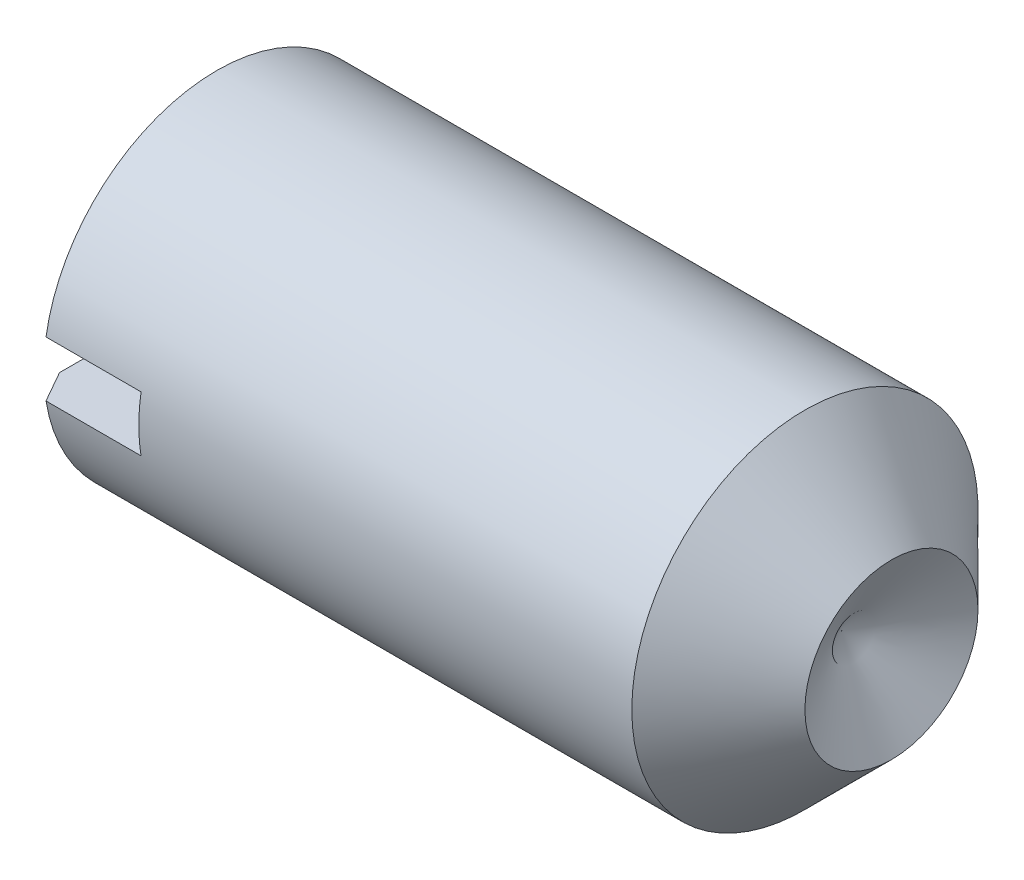
ISO-10303-21;
HEADER;
FILE_DESCRIPTION(('STEP AP214'),'2;1');
FILE_NAME('part.step','',(''),(''),'','','');
FILE_SCHEMA(('AUTOMOTIVE_DESIGN { 1 0 10303 214 1 1 1 1 }'));
ENDSEC;
DATA;
#1=APPLICATION_CONTEXT('core data for automotive mechanical design processes');
#2=APPLICATION_PROTOCOL_DEFINITION('international standard','automotive_design',2000,#1);
#3=PRODUCT_CONTEXT('',#1,'mechanical');
#4=PRODUCT('Part','Part','',(#3));
#5=PRODUCT_RELATED_PRODUCT_CATEGORY('part','',(#4));
#6=PRODUCT_DEFINITION_FORMATION('','',#4);
#7=PRODUCT_DEFINITION_CONTEXT('part definition',#1,'design');
#8=PRODUCT_DEFINITION('design','',#6,#7);
#9=PRODUCT_DEFINITION_SHAPE('','',#8);
#10=(LENGTH_UNIT() NAMED_UNIT(*) SI_UNIT(.MILLI.,.METRE.));
#11=(NAMED_UNIT(*) PLANE_ANGLE_UNIT() SI_UNIT($,.RADIAN.));
#12=(NAMED_UNIT(*) SI_UNIT($,.STERADIAN.) SOLID_ANGLE_UNIT());
#13=UNCERTAINTY_MEASURE_WITH_UNIT(LENGTH_MEASURE(1.E-05),#10,'distance_accuracy_value','');
#14=(GEOMETRIC_REPRESENTATION_CONTEXT(3) GLOBAL_UNCERTAINTY_ASSIGNED_CONTEXT((#13)) GLOBAL_UNIT_ASSIGNED_CONTEXT((#10,
#11,#12)) REPRESENTATION_CONTEXT('',''));
#15=CARTESIAN_POINT('',(0.,0.,0.));
#16=DIRECTION('',(0.,0.,1.));
#17=DIRECTION('',(1.,0.,0.));
#18=AXIS2_PLACEMENT_3D('',#15,#16,#17);
#19=CARTESIAN_POINT('',(0.,0.,0.));
#20=DIRECTION('',(-1.,0.,0.));
#21=DIRECTION('',(0.,0.,1.));
#22=AXIS2_PLACEMENT_3D('',#19,#20,#21);
#23=PLANE('',#22);
#24=CARTESIAN_POINT('',(0.,0.,0.));
#25=DIRECTION('',(-1.,0.,0.));
#26=DIRECTION('',(0.,0.,1.));
#27=AXIS2_PLACEMENT_3D('',#24,#25,#26);
#28=CIRCLE('',#27,2.055);
#29=CARTESIAN_POINT('',(0.,0.4,2.01569466933859));
#30=VERTEX_POINT('',#29);
#31=CARTESIAN_POINT('',(0.,0.4,-2.01569466933859));
#32=VERTEX_POINT('',#31);
#33=EDGE_CURVE('E102',#30,#32,#28,.T.);
#34=ORIENTED_EDGE('',*,*,#33,.T.);
#35=DIRECTION('',(0.,0.,1.));
#36=VECTOR('',#35,1.);
#37=CARTESIAN_POINT('',(0.,0.4,-2.5));
#38=LINE('',#37,#36);
#39=EDGE_CURVE('E91',#32,#30,#38,.T.);
#40=ORIENTED_EDGE('',*,*,#39,.T.);
#41=EDGE_LOOP('',(#34,#40));
#42=FACE_BOUND('',#41,.T.);
#43=ADVANCED_FACE('F30',(#42),#23,.T.);
#44=CARTESIAN_POINT('',(0.,-0.4,-2.01569466933859));
#45=VERTEX_POINT('',#44);
#46=CARTESIAN_POINT('',(0.,-0.4,2.01569466933859));
#47=VERTEX_POINT('',#46);
#48=EDGE_CURVE('E96',#45,#47,#28,.T.);
#49=ORIENTED_EDGE('',*,*,#48,.T.);
#50=DIRECTION('',(0.,0.,-1.));
#51=VECTOR('',#50,1.);
#52=CARTESIAN_POINT('',(0.,-0.4,-2.5));
#53=LINE('',#52,#51);
#54=EDGE_CURVE('E80',#47,#45,#53,.T.);
#55=ORIENTED_EDGE('',*,*,#54,.T.);
#56=EDGE_LOOP('',(#49,#55));
#57=FACE_BOUND('',#56,.T.);
#58=ADVANCED_FACE('F101',(#57),#23,.T.);
#59=CARTESIAN_POINT('',(-12.7,0.,0.));
#60=DIRECTION('',(-1.,0.,0.));
#61=DIRECTION('',(0.,0.,1.));
#62=AXIS2_PLACEMENT_3D('',#59,#60,#61);
#63=CYLINDRICAL_SURFACE('',#62,2.5);
#64=CARTESIAN_POINT('',(8.74999999999999,0.,0.));
#65=DIRECTION('',(-1.,0.,0.));
#66=DIRECTION('',(0.,0.,1.));
#67=AXIS2_PLACEMENT_3D('',#64,#65,#66);
#68=CIRCLE('',#67,2.5);
#69=CARTESIAN_POINT('',(8.74999999999999,0.,2.5));
#70=VERTEX_POINT('',#69);
#71=EDGE_CURVE('E113',#70,#70,#68,.T.);
#72=ORIENTED_EDGE('',*,*,#71,.T.);
#73=EDGE_LOOP('',(#72));
#74=FACE_BOUND('',#73,.T.);
#75=CARTESIAN_POINT('',(0.256920869789384,0.,0.));
#76=DIRECTION('',(-1.,0.,0.));
#77=DIRECTION('',(0.,0.,1.));
#78=AXIS2_PLACEMENT_3D('',#75,#76,#77);
#79=CIRCLE('',#78,2.5);
#80=CARTESIAN_POINT('',(0.256920869789384,0.4,2.46779253585061));
#81=VERTEX_POINT('',#80);
#82=CARTESIAN_POINT('',(0.256920869789384,0.4,-2.46779253585061));
#83=VERTEX_POINT('',#82);
#84=EDGE_CURVE('E112',#81,#83,#79,.T.);
#85=ORIENTED_EDGE('',*,*,#84,.F.);
#86=DIRECTION('',(-1.,0.,0.));
#87=VECTOR('',#86,1.);
#88=CARTESIAN_POINT('',(-12.7,0.4,2.46779253585061));
#89=LINE('',#88,#87);
#90=CARTESIAN_POINT('',(1.63,0.4,2.46779253585061));
#91=VERTEX_POINT('',#90);
#92=EDGE_CURVE('E107',#81,#91,#89,.F.);
#93=ORIENTED_EDGE('',*,*,#92,.T.);
#94=CARTESIAN_POINT('',(1.63,0.,0.));
#95=DIRECTION('',(1.,0.,0.));
#96=DIRECTION('',(0.,0.,-1.));
#97=AXIS2_PLACEMENT_3D('',#94,#95,#96);
#98=CIRCLE('',#97,2.5);
#99=CARTESIAN_POINT('',(1.63,-0.4,2.46779253585061));
#100=VERTEX_POINT('',#99);
#101=EDGE_CURVE('E11',#100,#91,#98,.F.);
#102=ORIENTED_EDGE('',*,*,#101,.F.);
#103=DIRECTION('',(-1.,0.,0.));
#104=VECTOR('',#103,1.);
#105=CARTESIAN_POINT('',(-12.7,-0.4,2.46779253585061));
#106=LINE('',#105,#104);
#107=CARTESIAN_POINT('',(0.256920869789384,-0.4,2.46779253585061));
#108=VERTEX_POINT('',#107);
#109=EDGE_CURVE('E166',#100,#108,#106,.T.);
#110=ORIENTED_EDGE('',*,*,#109,.T.);
#111=CARTESIAN_POINT('',(0.256920869789384,-0.4,-2.46779253585061));
#112=VERTEX_POINT('',#111);
#113=EDGE_CURVE('E98',#112,#108,#79,.T.);
#114=ORIENTED_EDGE('',*,*,#113,.F.);
#115=DIRECTION('',(-1.,0.,0.));
#116=VECTOR('',#115,1.);
#117=CARTESIAN_POINT('',(-12.7,-0.4,-2.46779253585061));
#118=LINE('',#117,#116);
#119=CARTESIAN_POINT('',(1.63,-0.4,-2.46779253585061));
#120=VERTEX_POINT('',#119);
#121=EDGE_CURVE('E44',#112,#120,#118,.F.);
#122=ORIENTED_EDGE('',*,*,#121,.T.);
#123=CARTESIAN_POINT('',(1.63,0.4,-2.46779253585061));
#124=VERTEX_POINT('',#123);
#125=EDGE_CURVE('E33',#124,#120,#98,.F.);
#126=ORIENTED_EDGE('',*,*,#125,.F.);
#127=DIRECTION('',(-1.,0.,0.));
#128=VECTOR('',#127,1.);
#129=CARTESIAN_POINT('',(-12.7,0.4,-2.46779253585061));
#130=LINE('',#129,#128);
#131=EDGE_CURVE('E103',#124,#83,#130,.T.);
#132=ORIENTED_EDGE('',*,*,#131,.T.);
#133=EDGE_LOOP('',(#85,#93,#102,#110,#114,#122,#126,#132));
#134=FACE_BOUND('',#133,.T.);
#135=ADVANCED_FACE('F151',(#74,#134),#63,.T.);
#136=CARTESIAN_POINT('',(0.,0.,0.));
#137=DIRECTION('',(1.,0.,0.));
#138=DIRECTION('',(0.,0.,-1.));
#139=AXIS2_PLACEMENT_3D('',#136,#137,#138);
#140=CONICAL_SURFACE('',#139,2.055,1.0471975511966);
#141=ORIENTED_EDGE('',*,*,#84,.T.);
#142=CARTESIAN_POINT('',(1.99975266385631,0.400000000000001,-5.50415788918553));
#143=CARTESIAN_POINT('',(1.8658103359631,0.400000000000001,-5.27154015354407));
#144=CARTESIAN_POINT('',(1.7318927150887,0.400000000000001,-5.03890815138334));
#145=CARTESIAN_POINT('',(1.46415926212048,0.4,-4.57358368781419));
#146=CARTESIAN_POINT('',(1.33034343065564,0.4,-4.3408912260439));
#147=CARTESIAN_POINT('',(1.06281639680919,0.4,-3.87532770596757));
#148=CARTESIAN_POINT('',(0.929105254062013,0.4,-3.64245661339261));
#149=CARTESIAN_POINT('',(0.661949129262218,0.4,-3.17656322339952));
#150=CARTESIAN_POINT('',(0.528504145855479,0.4,-2.94354092675868));
#151=CARTESIAN_POINT('',(0.329233754718011,0.4,-2.59465052545067));
#152=CARTESIAN_POINT('',(0.263207623133957,0.4,-2.47889709066342));
#153=CARTESIAN_POINT('',(0.131354675932059,0.4,-2.24727495892065));
#154=CARTESIAN_POINT('',(0.0655278625152638,0.4,-2.13140626071091));
#155=CARTESIAN_POINT('',(-0.0657957133914849,0.4,-1.89951009915013));
#156=CARTESIAN_POINT('',(-0.13129253431643,0.4,-1.78348266889142));
#157=CARTESIAN_POINT('',(-0.261748596281594,0.4,-1.55112938394883));
#158=CARTESIAN_POINT('',(-0.326707853617383,0.4,-1.43480353845209));
#159=CARTESIAN_POINT('',(-0.423492831348932,0.4,-1.25960838531949));
#160=CARTESIAN_POINT('',(-0.455717241363941,0.4,-1.20095955848626));
#161=CARTESIAN_POINT('',(-0.519759658453786,0.4,-1.08343412668641));
#162=CARTESIAN_POINT('',(-0.551577635826336,0.4,-1.0245575054775));
#163=CARTESIAN_POINT('',(-0.61458817364407,0.4,-0.906424570204478));
#164=CARTESIAN_POINT('',(-0.645780345595754,0.4,-0.84716804868768));
#165=CARTESIAN_POINT('',(-0.707083866133479,0.4,-0.728102663885795));
#166=CARTESIAN_POINT('',(-0.737195388086794,0.4,-0.668293891150839));
#167=CARTESIAN_POINT('',(-0.781111810423653,0.4,-0.577223832785877));
#168=CARTESIAN_POINT('',(-0.795678254640951,0.4,-0.546331915199578));
#169=CARTESIAN_POINT('',(-0.824021577959424,0.4,-0.484189743725332));
#170=CARTESIAN_POINT('',(-0.837798534087416,0.4,-0.452939525153455));
#171=CARTESIAN_POINT('',(-0.864195014289361,0.4,-0.389903918448635));
#172=CARTESIAN_POINT('',(-0.876813289075469,0.4,-0.358117995411425));
#173=CARTESIAN_POINT('',(-0.900241801337652,0.4,-0.293900263979747));
#174=CARTESIAN_POINT('',(-0.911052708637127,0.4,-0.261468699873502));
#175=CARTESIAN_POINT('',(-0.933091629860381,0.4,-0.184474564534091));
#176=CARTESIAN_POINT('',(-0.943199977280579,0.4,-0.139553389769663));
#177=CARTESIAN_POINT('',(-0.952196445514834,0.4,-0.0715175283773804));
#178=CARTESIAN_POINT('',(-0.954171584360777,0.4,-0.0488163928101711));
#179=CARTESIAN_POINT('',(-0.955877718528039,0.4,-0.00332746514652366));
#180=CARTESIAN_POINT('',(-0.955608941515286,0.4,0.0194603179242393));
#181=CARTESIAN_POINT('',(-0.952862700970307,0.4,0.0648478323826145));
#182=CARTESIAN_POINT('',(-0.95038996153807,0.4,0.087447861689451));
#183=CARTESIAN_POINT('',(-0.943522807112406,0.4,0.132356399366625));
#184=CARTESIAN_POINT('',(-0.939127386286363,0.4,0.154664748847889));
#185=CARTESIAN_POINT('',(-0.928749610086366,0.4,0.199134445487709));
#186=CARTESIAN_POINT('',(-0.922751897552224,0.4,0.221292120476777));
#187=CARTESIAN_POINT('',(-0.909566884486628,0.4,0.265241865847103));
#188=CARTESIAN_POINT('',(-0.902379691169388,0.4,0.287033968984494));
#189=CARTESIAN_POINT('',(-0.885701458242499,0.4,0.334322152583431));
#190=CARTESIAN_POINT('',(-0.87603048063784,0.4,0.359754097619194));
#191=CARTESIAN_POINT('',(-0.855804227990405,0.4,0.410266079147623));
#192=CARTESIAN_POINT('',(-0.845248745063719,0.4,0.435346031285783));
#193=CARTESIAN_POINT('',(-0.812631016051292,0.4,0.5102144806375));
#194=CARTESIAN_POINT('',(-0.789632256426325,0.4,0.559592445524428));
#195=CARTESIAN_POINT('',(-0.742231905594633,0.4,0.657811451702355));
#196=CARTESIAN_POINT('',(-0.717826880930886,0.4,0.706650799206687));
#197=CARTESIAN_POINT('',(-0.668213443630346,0.4,0.803889812410477));
#198=CARTESIAN_POINT('',(-0.643005416003516,0.4,0.852289674937124));
#199=CARTESIAN_POINT('',(-0.592012676838021,0.4,0.948929712347764));
#200=CARTESIAN_POINT('',(-0.566226741430545,0.4,0.997169238004592));
#201=CARTESIAN_POINT('',(-0.514301279179256,0.4,1.09346475416683));
#202=CARTESIAN_POINT('',(-0.48816171059543,0.4,1.14152072213283));
#203=CARTESIAN_POINT('',(-0.409465380662371,0.4,1.28533251702175));
#204=CARTESIAN_POINT('',(-0.356546727111275,0.4,1.38088998919773));
#205=CARTESIAN_POINT('',(-0.208328875757147,0.4,1.64687493069345));
#206=CARTESIAN_POINT('',(-0.112477401891236,0.4,1.81699352416992));
#207=CARTESIAN_POINT('',(0.0798994767576205,0.4,2.15685311762392));
#208=CARTESIAN_POINT('',(0.176424897421533,0.4,2.32659410857844));
#209=CARTESIAN_POINT('',(0.369908285272924,0.4,2.66599393675287));
#210=CARTESIAN_POINT('',(0.466866517238092,0.399999999999999,2.83565262302763));
#211=CARTESIAN_POINT('',(0.66099163909377,0.399999999999999,3.17484858613286));
#212=CARTESIAN_POINT('',(0.758158527229451,0.399999999999999,3.34438586396853));
#213=CARTESIAN_POINT('',(1.04585561564739,0.399999999999999,3.84591609355065));
#214=CARTESIAN_POINT('',(1.236569901157,0.399999999999999,4.17780343580322));
#215=CARTESIAN_POINT('',(1.52274255395641,0.399999999999999,4.67540858664864));
#216=CARTESIAN_POINT('',(1.61811406010065,0.399999999999999,4.84117639754927));
#217=CARTESIAN_POINT('',(1.80890237090214,0.399999999999999,5.1726853009633));
#218=CARTESIAN_POINT('',(1.90431917542531,0.399999999999999,5.33842639355389));
#219=CARTESIAN_POINT('',(1.99975266385631,0.399999999999999,5.50415788918553));
#220=B_SPLINE_CURVE_WITH_KNOTS('',3,(#142,#143,#144,#145,#146,#147,#148,#149,#150,#151,#152,
#153,#154,#155,#156,#157,#158,#159,#160,#161,#162,#163,#164,#165,#166,#167,#168,#169,#170,#171,
#172,#173,#174,#175,#176,#177,#178,#179,#180,#181,#182,#183,#184,#185,#186,#187,#188,#189,#190,
#191,#192,#193,#194,#195,#196,#197,#198,#199,#200,#201,#202,#203,#204,#205,#206,#207,#208,#209,
#210,#211,#212,#213,#214,#215,#216,#217,#218,#219),.UNSPECIFIED.,.F.,.F.,(4,2,2,2,2,2,2,2,2,2,2,
2,2,2,2,2,2,2,2,2,2,2,2,2,2,2,2,2,2,2,2,2,2,2,2,2,2,2,4),(0.,0.805272695375546,1.61055032690449,
2.41613611600352,3.22171779606534,3.62149859926978,4.02128380122598,4.42099552864538,
4.82069509458634,5.02144998768932,5.22221946906869,5.42310995328419,5.6239680635051,
5.72642206764429,5.82886605872635,5.93141923868055,6.0339343270265,6.17147767841388,
6.23973831949588,6.30799203499143,6.37609980243458,6.44424324250445,6.51306481519466,
6.58188018800645,6.66348200949075,6.74510306380749,6.90847045543103,7.07225516924307,
7.23596250259171,7.40005736367545,7.56417176517019,7.89186404840738,8.47765054550188,
9.06345089304579,9.64967979358178,10.2359037830028,11.3842459111627,11.9579812399317,
12.5317148807842),.UNSPECIFIED.);
#221=EDGE_CURVE('E159',#83,#32,#220,.T.);
#222=ORIENTED_EDGE('',*,*,#221,.T.);
#223=ORIENTED_EDGE('',*,*,#33,.F.);
#224=EDGE_CURVE('E99',#30,#81,#220,.T.);
#225=ORIENTED_EDGE('',*,*,#224,.T.);
#226=EDGE_LOOP('',(#141,#222,#223,#225));
#227=FACE_BOUND('',#226,.T.);
#228=ADVANCED_FACE('F127',(#227),#140,.T.);
#229=ORIENTED_EDGE('',*,*,#113,.T.);
#230=CARTESIAN_POINT('',(1.99975266385631,-0.400000000000001,5.50415788918553));
#231=CARTESIAN_POINT('',(1.8658103359631,-0.400000000000001,5.27154015354407));
#232=CARTESIAN_POINT('',(1.7318927150887,-0.400000000000001,5.03890815138334));
#233=CARTESIAN_POINT('',(1.46415926212048,-0.400000000000001,4.57358368781419));
#234=CARTESIAN_POINT('',(1.33034343065563,-0.400000000000001,4.3408912260439));
#235=CARTESIAN_POINT('',(1.06281639680919,-0.400000000000001,3.87532770596756));
#236=CARTESIAN_POINT('',(0.929105254062011,-0.400000000000001,3.64245661339261));
#237=CARTESIAN_POINT('',(0.661949129262215,-0.400000000000001,3.17656322339951));
#238=CARTESIAN_POINT('',(0.528504145855475,-0.400000000000001,2.94354092675867));
#239=CARTESIAN_POINT('',(0.329233754718007,-0.4,2.59465052545066));
#240=CARTESIAN_POINT('',(0.263207623133954,-0.4,2.47889709066342));
#241=CARTESIAN_POINT('',(0.131354675932056,-0.4,2.24727495892064));
#242=CARTESIAN_POINT('',(0.0655278625152604,-0.4,2.1314062607109));
#243=CARTESIAN_POINT('',(-0.0657957133914881,-0.4,1.89951009915012));
#244=CARTESIAN_POINT('',(-0.131292534316434,-0.4,1.78348266889142));
#245=CARTESIAN_POINT('',(-0.261748596281597,-0.4,1.55112938394882));
#246=CARTESIAN_POINT('',(-0.326707853617386,-0.4,1.43480353845209));
#247=CARTESIAN_POINT('',(-0.423492831348934,-0.4,1.25960838531948));
#248=CARTESIAN_POINT('',(-0.455717241363943,-0.4,1.20095955848626));
#249=CARTESIAN_POINT('',(-0.519759658453787,-0.4,1.0834341266864));
#250=CARTESIAN_POINT('',(-0.551577635826338,-0.4,1.0245575054775));
#251=CARTESIAN_POINT('',(-0.614588173644071,-0.4,0.906424570204476));
#252=CARTESIAN_POINT('',(-0.645780345595755,-0.4,0.847168048687678));
#253=CARTESIAN_POINT('',(-0.70708386613348,-0.4,0.728102663885793));
#254=CARTESIAN_POINT('',(-0.737195388086795,-0.4,0.668293891150836));
#255=CARTESIAN_POINT('',(-0.781111810423654,-0.4,0.577223832785874));
#256=CARTESIAN_POINT('',(-0.795678254640952,-0.4,0.546331915199575));
#257=CARTESIAN_POINT('',(-0.824021577959424,-0.4,0.48418974372533));
#258=CARTESIAN_POINT('',(-0.837798534087416,-0.4,0.452939525153453));
#259=CARTESIAN_POINT('',(-0.864195014289362,-0.4,0.389903918448633));
#260=CARTESIAN_POINT('',(-0.876813289075469,-0.4,0.358117995411424));
#261=CARTESIAN_POINT('',(-0.900241801337652,-0.4,0.293900263979745));
#262=CARTESIAN_POINT('',(-0.911052708637127,-0.4,0.2614686998735));
#263=CARTESIAN_POINT('',(-0.933091629860382,-0.4,0.184474564534089));
#264=CARTESIAN_POINT('',(-0.943199977280579,-0.4,0.139553389769661));
#265=CARTESIAN_POINT('',(-0.952196445514835,-0.4,0.0715175283773785));
#266=CARTESIAN_POINT('',(-0.954171584360777,-0.4,0.0488163928101692));
#267=CARTESIAN_POINT('',(-0.955877718528039,-0.4,0.00332746514652187));
#268=CARTESIAN_POINT('',(-0.955608941515286,-0.4,-0.019460317924241));
#269=CARTESIAN_POINT('',(-0.952862700970307,-0.4,-0.064847832382616));
#270=CARTESIAN_POINT('',(-0.95038996153807,-0.4,-0.0874478616894522));
#271=CARTESIAN_POINT('',(-0.943522807112406,-0.4,-0.132356399366626));
#272=CARTESIAN_POINT('',(-0.939127386286363,-0.4,-0.15466474884789));
#273=CARTESIAN_POINT('',(-0.928749610086365,-0.4,-0.19913444548771));
#274=CARTESIAN_POINT('',(-0.922751897552224,-0.4,-0.221292120476779));
#275=CARTESIAN_POINT('',(-0.909566884486627,-0.4,-0.265241865847105));
#276=CARTESIAN_POINT('',(-0.902379691169387,-0.4,-0.287033968984495));
#277=CARTESIAN_POINT('',(-0.885701458242498,-0.4,-0.334322152583433));
#278=CARTESIAN_POINT('',(-0.876030480637839,-0.4,-0.359754097619196));
#279=CARTESIAN_POINT('',(-0.855804227990404,-0.4,-0.410266079147625));
#280=CARTESIAN_POINT('',(-0.845248745063718,-0.4,-0.435346031285785));
#281=CARTESIAN_POINT('',(-0.812631016051291,-0.4,-0.510214480637503));
#282=CARTESIAN_POINT('',(-0.789632256426324,-0.4,-0.55959244552443));
#283=CARTESIAN_POINT('',(-0.742231905594631,-0.4,-0.657811451702358));
#284=CARTESIAN_POINT('',(-0.717826880930885,-0.4,-0.706650799206689));
#285=CARTESIAN_POINT('',(-0.668213443630344,-0.4,-0.80388981241048));
#286=CARTESIAN_POINT('',(-0.643005416003514,-0.4,-0.852289674937128));
#287=CARTESIAN_POINT('',(-0.592012676838018,-0.4,-0.948929712347768));
#288=CARTESIAN_POINT('',(-0.566226741430543,-0.4,-0.997169238004597));
#289=CARTESIAN_POINT('',(-0.514301279179253,-0.4,-1.09346475416683));
#290=CARTESIAN_POINT('',(-0.488161710595427,-0.4,-1.14152072213284));
#291=CARTESIAN_POINT('',(-0.409465380662367,-0.4,-1.28533251702175));
#292=CARTESIAN_POINT('',(-0.356546727111271,-0.4,-1.38088998919774));
#293=CARTESIAN_POINT('',(-0.208328875757143,-0.4,-1.64687493069346));
#294=CARTESIAN_POINT('',(-0.112477401891232,-0.4,-1.81699352416993));
#295=CARTESIAN_POINT('',(0.0798994767576245,-0.4,-2.15685311762392));
#296=CARTESIAN_POINT('',(0.176424897421537,-0.4,-2.32659410857845));
#297=CARTESIAN_POINT('',(0.369908285272928,-0.4,-2.66599393675287));
#298=CARTESIAN_POINT('',(0.466866517238095,-0.4,-2.83565262302763));
#299=CARTESIAN_POINT('',(0.660991639093772,-0.4,-3.17484858613287));
#300=CARTESIAN_POINT('',(0.758158527229453,-0.4,-3.34438586396854));
#301=CARTESIAN_POINT('',(1.0458556156474,-0.4,-3.84591609355065));
#302=CARTESIAN_POINT('',(1.236569901157,-0.4,-4.17780343580322));
#303=CARTESIAN_POINT('',(1.52274255395641,-0.399999999999999,-4.67540858664864));
#304=CARTESIAN_POINT('',(1.61811406010065,-0.399999999999999,-4.84117639754927));
#305=CARTESIAN_POINT('',(1.80890237090214,-0.399999999999999,-5.17268530096331));
#306=CARTESIAN_POINT('',(1.90431917542531,-0.399999999999999,-5.33842639355389));
#307=CARTESIAN_POINT('',(1.99975266385631,-0.399999999999999,-5.50415788918553));
#308=B_SPLINE_CURVE_WITH_KNOTS('',3,(#230,#231,#232,#233,#234,#235,#236,#237,#238,#239,#240,
#241,#242,#243,#244,#245,#246,#247,#248,#249,#250,#251,#252,#253,#254,#255,#256,#257,#258,#259,
#260,#261,#262,#263,#264,#265,#266,#267,#268,#269,#270,#271,#272,#273,#274,#275,#276,#277,#278,
#279,#280,#281,#282,#283,#284,#285,#286,#287,#288,#289,#290,#291,#292,#293,#294,#295,#296,#297,
#298,#299,#300,#301,#302,#303,#304,#305,#306,#307),.UNSPECIFIED.,.F.,.F.,(4,2,2,2,2,2,2,2,2,2,2,
2,2,2,2,2,2,2,2,2,2,2,2,2,2,2,2,2,2,2,2,2,2,2,2,2,2,2,4),(0.,0.805272695375549,1.6105503269045,
2.41613611600352,3.22171779606535,3.62149859926979,4.02128380122598,4.42099552864539,
4.82069509458635,5.02144998768933,5.2222194690687,5.42310995328419,5.6239680635051,
5.7264220676443,5.82886605872636,5.93141923868056,6.0339343270265,6.17147767841388,
6.23973831949589,6.30799203499143,6.37609980243458,6.44424324250445,6.51306481519466,
6.58188018800645,6.66348200949075,6.74510306380749,6.90847045543103,7.07225516924308,
7.23596250259172,7.40005736367546,7.5641717651702,7.8918640484074,8.47765054550189,
9.0634508930458,9.64967979358179,10.2359037830028,11.3842459111627,11.9579812399317,
12.5317148807842),.UNSPECIFIED.);
#309=EDGE_CURVE('E84',#108,#47,#308,.T.);
#310=ORIENTED_EDGE('',*,*,#309,.T.);
#311=ORIENTED_EDGE('',*,*,#48,.F.);
#312=EDGE_CURVE('E86',#45,#112,#308,.T.);
#313=ORIENTED_EDGE('',*,*,#312,.T.);
#314=EDGE_LOOP('',(#229,#310,#311,#313));
#315=FACE_BOUND('',#314,.T.);
#316=ADVANCED_FACE('F95',(#315),#140,.T.);
#317=CARTESIAN_POINT('',(10.,0.,0.));
#318=DIRECTION('',(1.,0.,0.));
#319=DIRECTION('',(0.,0.,-1.));
#320=AXIS2_PLACEMENT_3D('',#317,#318,#319);
#321=CONICAL_SURFACE('',#320,1.25,1.0471975511966);
#322=CARTESIAN_POINT('',(9.27831216351297,0.,0.));
#323=VERTEX_POINT('',#322);
#324=VERTEX_LOOP('',#323);
#325=FACE_BOUND('',#324,.T.);
#326=CARTESIAN_POINT('',(10.,0.,0.));
#327=DIRECTION('',(-1.,0.,0.));
#328=DIRECTION('',(0.,0.,1.));
#329=AXIS2_PLACEMENT_3D('',#326,#327,#328);
#330=CIRCLE('',#329,1.25);
#331=CARTESIAN_POINT('',(10.,0.,1.25));
#332=VERTEX_POINT('',#331);
#333=EDGE_CURVE('E116',#332,#332,#330,.T.);
#334=ORIENTED_EDGE('',*,*,#333,.F.);
#335=EDGE_LOOP('',(#334));
#336=FACE_BOUND('',#335,.T.);
#337=ADVANCED_FACE('F142',(#325,#336),#321,.F.);
#338=CARTESIAN_POINT('',(10.,0.,0.));
#339=DIRECTION('',(-1.,0.,0.));
#340=DIRECTION('',(0.,0.,1.));
#341=AXIS2_PLACEMENT_3D('',#338,#339,#340);
#342=CONICAL_SURFACE('',#341,1.25,0.785398163397445);
#343=ORIENTED_EDGE('',*,*,#71,.F.);
#344=EDGE_LOOP('',(#343));
#345=FACE_BOUND('',#344,.T.);
#346=ORIENTED_EDGE('',*,*,#333,.T.);
#347=EDGE_LOOP('',(#346));
#348=FACE_BOUND('',#347,.T.);
#349=ADVANCED_FACE('F137',(#345,#348),#342,.T.);
#350=CARTESIAN_POINT('',(1.63,0.4,-2.5));
#351=DIRECTION('',(0.,-1.,0.));
#352=DIRECTION('',(0.,0.,-1.));
#353=AXIS2_PLACEMENT_3D('',#350,#351,#352);
#354=PLANE('',#353);
#355=DIRECTION('',(0.,0.,1.));
#356=VECTOR('',#355,1.);
#357=CARTESIAN_POINT('',(1.63,0.4,-2.5));
#358=LINE('',#357,#356);
#359=EDGE_CURVE('E90',#124,#91,#358,.T.);
#360=ORIENTED_EDGE('',*,*,#359,.T.);
#361=ORIENTED_EDGE('',*,*,#92,.F.);
#362=ORIENTED_EDGE('',*,*,#224,.F.);
#363=ORIENTED_EDGE('',*,*,#39,.F.);
#364=ORIENTED_EDGE('',*,*,#221,.F.);
#365=ORIENTED_EDGE('',*,*,#131,.F.);
#366=EDGE_LOOP('',(#360,#361,#362,#363,#364,#365));
#367=FACE_BOUND('',#366,.T.);
#368=ADVANCED_FACE('F134',(#367),#354,.T.);
#369=CARTESIAN_POINT('',(1.63,-0.4,-2.5));
#370=DIRECTION('',(0.,1.,0.));
#371=DIRECTION('',(0.,0.,1.));
#372=AXIS2_PLACEMENT_3D('',#369,#370,#371);
#373=PLANE('',#372);
#374=DIRECTION('',(0.,0.,-1.));
#375=VECTOR('',#374,1.);
#376=CARTESIAN_POINT('',(1.63,-0.4,-2.5));
#377=LINE('',#376,#375);
#378=EDGE_CURVE('E164',#100,#120,#377,.T.);
#379=ORIENTED_EDGE('',*,*,#378,.T.);
#380=ORIENTED_EDGE('',*,*,#121,.F.);
#381=ORIENTED_EDGE('',*,*,#312,.F.);
#382=ORIENTED_EDGE('',*,*,#54,.F.);
#383=ORIENTED_EDGE('',*,*,#309,.F.);
#384=ORIENTED_EDGE('',*,*,#109,.F.);
#385=EDGE_LOOP('',(#379,#380,#381,#382,#383,#384));
#386=FACE_BOUND('',#385,.T.);
#387=ADVANCED_FACE('F82',(#386),#373,.T.);
#388=CARTESIAN_POINT('',(1.63,0.4,-2.5));
#389=DIRECTION('',(1.,0.,0.));
#390=DIRECTION('',(0.,0.,-1.));
#391=AXIS2_PLACEMENT_3D('',#388,#389,#390);
#392=PLANE('',#391);
#393=ORIENTED_EDGE('',*,*,#378,.F.);
#394=ORIENTED_EDGE('',*,*,#101,.T.);
#395=ORIENTED_EDGE('',*,*,#359,.F.);
#396=ORIENTED_EDGE('',*,*,#125,.T.);
#397=EDGE_LOOP('',(#393,#394,#395,#396));
#398=FACE_BOUND('',#397,.T.);
#399=ADVANCED_FACE('F133',(#398),#392,.F.);
#400=CLOSED_SHELL('',(#43,#58,#135,#228,#316,#337,#349,#368,#387,#399));
#401=MANIFOLD_SOLID_BREP('B2',#400);
#402=ADVANCED_BREP_SHAPE_REPRESENTATION('',(#18,#401),#14);
#403=SHAPE_DEFINITION_REPRESENTATION(#9,#402);
ENDSEC;
END-ISO-10303-21;
